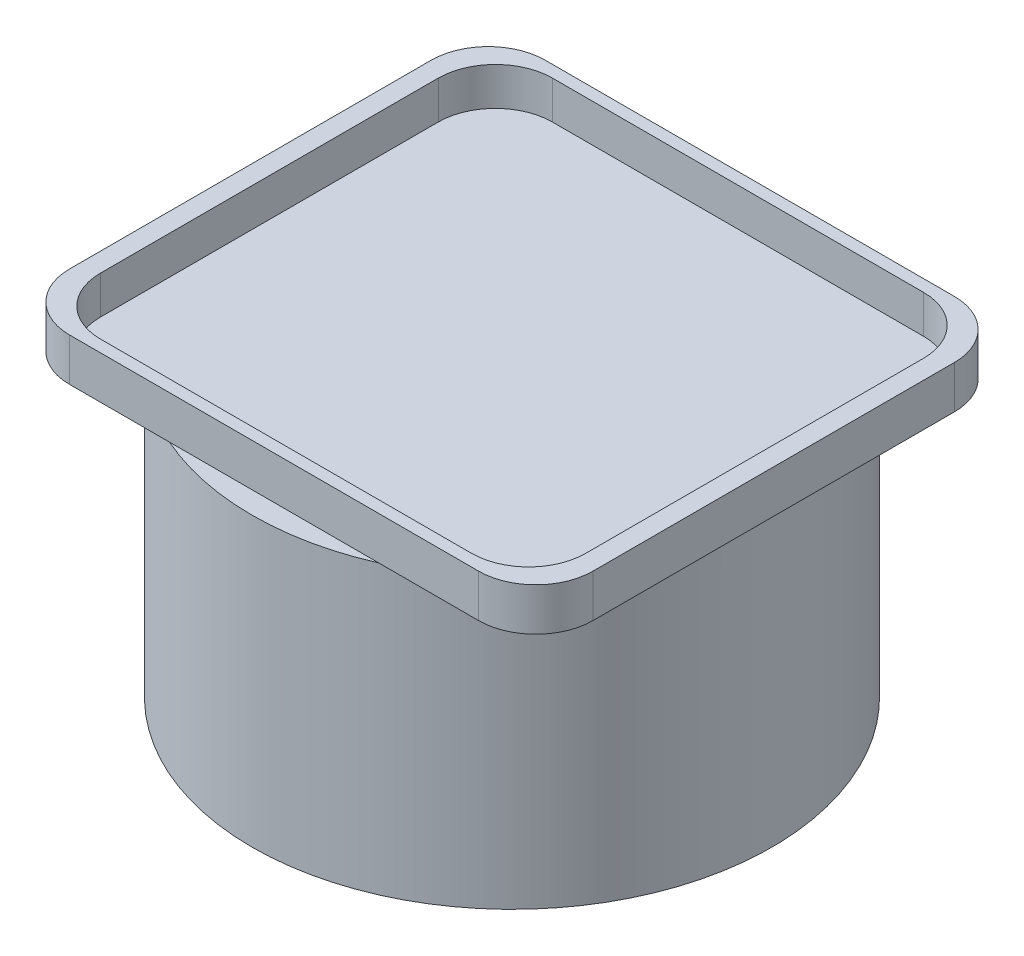
ISO-10303-21;
HEADER;
FILE_DESCRIPTION(('STEP AP214'),'2;1');
FILE_NAME('part.step','',(''),(''),'','','');
FILE_SCHEMA(('AUTOMOTIVE_DESIGN { 1 0 10303 214 1 1 1 1 }'));
ENDSEC;
DATA;
#1=APPLICATION_CONTEXT('core data for automotive mechanical design processes');
#2=APPLICATION_PROTOCOL_DEFINITION('international standard','automotive_design',2000,#1);
#3=PRODUCT_CONTEXT('',#1,'mechanical');
#4=PRODUCT('Part','Part','',(#3));
#5=PRODUCT_RELATED_PRODUCT_CATEGORY('part','',(#4));
#6=PRODUCT_DEFINITION_FORMATION('','',#4);
#7=PRODUCT_DEFINITION_CONTEXT('part definition',#1,'design');
#8=PRODUCT_DEFINITION('design','',#6,#7);
#9=PRODUCT_DEFINITION_SHAPE('','',#8);
#10=(LENGTH_UNIT() NAMED_UNIT(*) SI_UNIT(.MILLI.,.METRE.));
#11=(NAMED_UNIT(*) PLANE_ANGLE_UNIT() SI_UNIT($,.RADIAN.));
#12=(NAMED_UNIT(*) SI_UNIT($,.STERADIAN.) SOLID_ANGLE_UNIT());
#13=UNCERTAINTY_MEASURE_WITH_UNIT(LENGTH_MEASURE(1.E-05),#10,'distance_accuracy_value','');
#14=(GEOMETRIC_REPRESENTATION_CONTEXT(3) GLOBAL_UNCERTAINTY_ASSIGNED_CONTEXT((#13)) GLOBAL_UNIT_ASSIGNED_CONTEXT((#10,
#11,#12)) REPRESENTATION_CONTEXT('',''));
#15=CARTESIAN_POINT('',(0.,0.,0.));
#16=DIRECTION('',(0.,0.,1.));
#17=DIRECTION('',(1.,0.,0.));
#18=AXIS2_PLACEMENT_3D('',#15,#16,#17);
#19=CARTESIAN_POINT('',(-10.922,-0.254,-9.652));
#20=DIRECTION('',(0.,-1.,0.));
#21=DIRECTION('',(0.,0.,-1.));
#22=AXIS2_PLACEMENT_3D('',#19,#20,#21);
#23=PLANE('',#22);
#24=CARTESIAN_POINT('',(0.,-0.254,0.));
#25=DIRECTION('',(0.,-1.,0.));
#26=DIRECTION('',(0.,0.,-1.));
#27=AXIS2_PLACEMENT_3D('',#24,#25,#26);
#28=CIRCLE('',#27,13.87475);
#29=CARTESIAN_POINT('',(5.58736857227979,-0.254,-12.7));
#30=VERTEX_POINT('',#29);
#31=CARTESIAN_POINT('',(5.5873685722798,-0.254,12.7));
#32=VERTEX_POINT('',#31);
#33=EDGE_CURVE('E50',#30,#32,#28,.T.);
#34=ORIENTED_EDGE('',*,*,#33,.F.);
#35=DIRECTION('',(1.,0.,0.));
#36=VECTOR('',#35,1.);
#37=CARTESIAN_POINT('',(-10.922,-0.254,-12.7));
#38=LINE('',#37,#36);
#39=CARTESIAN_POINT('',(10.922,-0.254,-12.7));
#40=VERTEX_POINT('',#39);
#41=EDGE_CURVE('E178',#30,#40,#38,.T.);
#42=ORIENTED_EDGE('',*,*,#41,.T.);
#43=CARTESIAN_POINT('',(10.922,-0.254,-9.652));
#44=DIRECTION('',(0.,-1.,0.));
#45=DIRECTION('',(0.,0.,-1.));
#46=AXIS2_PLACEMENT_3D('',#43,#44,#45);
#47=CIRCLE('',#46,3.048);
#48=CARTESIAN_POINT('',(13.97,-0.254,-9.652));
#49=VERTEX_POINT('',#48);
#50=EDGE_CURVE('E175',#40,#49,#47,.T.);
#51=ORIENTED_EDGE('',*,*,#50,.T.);
#52=DIRECTION('',(0.,0.,1.));
#53=VECTOR('',#52,1.);
#54=CARTESIAN_POINT('',(13.97,-0.254,-9.652));
#55=LINE('',#54,#53);
#56=CARTESIAN_POINT('',(13.97,-0.254,9.65199999999998));
#57=VERTEX_POINT('',#56);
#58=EDGE_CURVE('E206',#49,#57,#55,.T.);
#59=ORIENTED_EDGE('',*,*,#58,.T.);
#60=CARTESIAN_POINT('',(10.922,-0.254,9.652));
#61=DIRECTION('',(0.,-1.,0.));
#62=DIRECTION('',(0.,0.,-1.));
#63=AXIS2_PLACEMENT_3D('',#60,#61,#62);
#64=CIRCLE('',#63,3.048);
#65=CARTESIAN_POINT('',(10.922,-0.254,12.7));
#66=VERTEX_POINT('',#65);
#67=EDGE_CURVE('E210',#57,#66,#64,.T.);
#68=ORIENTED_EDGE('',*,*,#67,.T.);
#69=DIRECTION('',(-1.,0.,0.));
#70=VECTOR('',#69,1.);
#71=CARTESIAN_POINT('',(10.922,-0.254,12.7));
#72=LINE('',#71,#70);
#73=EDGE_CURVE('E215',#66,#32,#72,.T.);
#74=ORIENTED_EDGE('',*,*,#73,.T.);
#75=EDGE_LOOP('',(#34,#42,#51,#59,#68,#74));
#76=FACE_BOUND('',#75,.T.);
#77=ADVANCED_FACE('F39',(#76),#23,.T.);
#78=CARTESIAN_POINT('',(-10.922,2.032,-9.652));
#79=DIRECTION('',(0.,-1.,0.));
#80=DIRECTION('',(0.,0.,-1.));
#81=AXIS2_PLACEMENT_3D('',#78,#79,#80);
#82=PLANE('',#81);
#83=CARTESIAN_POINT('',(-10.922,2.032,-9.652));
#84=DIRECTION('',(0.,1.,0.));
#85=DIRECTION('',(0.,0.,-1.));
#86=AXIS2_PLACEMENT_3D('',#83,#84,#85);
#87=CIRCLE('',#86,3.048);
#88=CARTESIAN_POINT('',(-10.922,2.032,-12.7));
#89=VERTEX_POINT('',#88);
#90=CARTESIAN_POINT('',(-13.97,2.032,-9.65199999999998));
#91=VERTEX_POINT('',#90);
#92=EDGE_CURVE('E309',#89,#91,#87,.T.);
#93=ORIENTED_EDGE('',*,*,#92,.T.);
#94=DIRECTION('',(0.,0.,1.));
#95=VECTOR('',#94,1.);
#96=CARTESIAN_POINT('',(-13.97,2.032,9.65199999999998));
#97=LINE('',#96,#95);
#98=CARTESIAN_POINT('',(-13.97,2.032,9.65199999999998));
#99=VERTEX_POINT('',#98);
#100=EDGE_CURVE('E313',#91,#99,#97,.T.);
#101=ORIENTED_EDGE('',*,*,#100,.T.);
#102=CARTESIAN_POINT('',(-10.922,2.032,9.652));
#103=DIRECTION('',(0.,1.,0.));
#104=DIRECTION('',(0.,0.,-1.));
#105=AXIS2_PLACEMENT_3D('',#102,#103,#104);
#106=CIRCLE('',#105,3.048);
#107=CARTESIAN_POINT('',(-10.922,2.032,12.7));
#108=VERTEX_POINT('',#107);
#109=EDGE_CURVE('E316',#99,#108,#106,.T.);
#110=ORIENTED_EDGE('',*,*,#109,.T.);
#111=DIRECTION('',(1.,0.,0.));
#112=VECTOR('',#111,1.);
#113=CARTESIAN_POINT('',(-10.922,2.032,12.7));
#114=LINE('',#113,#112);
#115=CARTESIAN_POINT('',(10.922,2.032,12.7));
#116=VERTEX_POINT('',#115);
#117=EDGE_CURVE('E319',#108,#116,#114,.T.);
#118=ORIENTED_EDGE('',*,*,#117,.T.);
#119=CARTESIAN_POINT('',(10.922,2.032,9.652));
#120=DIRECTION('',(0.,1.,0.));
#121=DIRECTION('',(0.,0.,-1.));
#122=AXIS2_PLACEMENT_3D('',#119,#120,#121);
#123=CIRCLE('',#122,3.048);
#124=CARTESIAN_POINT('',(13.97,2.032,9.65199999999998));
#125=VERTEX_POINT('',#124);
#126=EDGE_CURVE('E322',#116,#125,#123,.T.);
#127=ORIENTED_EDGE('',*,*,#126,.T.);
#128=DIRECTION('',(0.,0.,-1.));
#129=VECTOR('',#128,1.);
#130=CARTESIAN_POINT('',(13.97,2.032,9.65199999999998));
#131=LINE('',#130,#129);
#132=CARTESIAN_POINT('',(13.97,2.032,-9.65199999999998));
#133=VERTEX_POINT('',#132);
#134=EDGE_CURVE('E325',#125,#133,#131,.T.);
#135=ORIENTED_EDGE('',*,*,#134,.T.);
#136=CARTESIAN_POINT('',(10.922,2.032,-9.652));
#137=DIRECTION('',(0.,1.,0.));
#138=DIRECTION('',(0.,0.,-1.));
#139=AXIS2_PLACEMENT_3D('',#136,#137,#138);
#140=CIRCLE('',#139,3.048);
#141=CARTESIAN_POINT('',(10.922,2.032,-12.7));
#142=VERTEX_POINT('',#141);
#143=EDGE_CURVE('E328',#133,#142,#140,.T.);
#144=ORIENTED_EDGE('',*,*,#143,.T.);
#145=DIRECTION('',(-1.,0.,0.));
#146=VECTOR('',#145,1.);
#147=CARTESIAN_POINT('',(-10.922,2.032,-12.7));
#148=LINE('',#147,#146);
#149=EDGE_CURVE('E331',#142,#89,#148,.T.);
#150=ORIENTED_EDGE('',*,*,#149,.T.);
#151=EDGE_LOOP('',(#93,#101,#110,#118,#127,#135,#144,#150));
#152=FACE_BOUND('',#151,.T.);
#153=CARTESIAN_POINT('',(-9.906,2.032,9.017));
#154=DIRECTION('',(0.,1.,0.));
#155=DIRECTION('',(0.,0.,1.));
#156=AXIS2_PLACEMENT_3D('',#153,#154,#155);
#157=CIRCLE('',#156,3.048);
#158=CARTESIAN_POINT('',(-12.954,2.032,9.01699999999998));
#159=VERTEX_POINT('',#158);
#160=CARTESIAN_POINT('',(-9.90599999999998,2.032,12.065));
#161=VERTEX_POINT('',#160);
#162=EDGE_CURVE('E226',#159,#161,#157,.T.);
#163=ORIENTED_EDGE('',*,*,#162,.F.);
#164=DIRECTION('',(0.,0.,1.));
#165=VECTOR('',#164,1.);
#166=CARTESIAN_POINT('',(-12.954,2.032,9.01699999999998));
#167=LINE('',#166,#165);
#168=CARTESIAN_POINT('',(-12.954,2.032,-9.01699999999998));
#169=VERTEX_POINT('',#168);
#170=EDGE_CURVE('E249',#169,#159,#167,.T.);
#171=ORIENTED_EDGE('',*,*,#170,.F.);
#172=CARTESIAN_POINT('',(-9.906,2.032,-9.017));
#173=DIRECTION('',(0.,1.,0.));
#174=DIRECTION('',(0.,0.,1.));
#175=AXIS2_PLACEMENT_3D('',#172,#173,#174);
#176=CIRCLE('',#175,3.048);
#177=CARTESIAN_POINT('',(-9.90599999999998,2.032,-12.065));
#178=VERTEX_POINT('',#177);
#179=EDGE_CURVE('E245',#178,#169,#176,.T.);
#180=ORIENTED_EDGE('',*,*,#179,.F.);
#181=DIRECTION('',(-1.,0.,0.));
#182=VECTOR('',#181,1.);
#183=CARTESIAN_POINT('',(-9.90599999999998,2.032,-12.065));
#184=LINE('',#183,#182);
#185=CARTESIAN_POINT('',(9.90599999999998,2.032,-12.065));
#186=VERTEX_POINT('',#185);
#187=EDGE_CURVE('E242',#186,#178,#184,.T.);
#188=ORIENTED_EDGE('',*,*,#187,.F.);
#189=CARTESIAN_POINT('',(9.906,2.032,-9.017));
#190=DIRECTION('',(0.,1.,0.));
#191=DIRECTION('',(0.,0.,1.));
#192=AXIS2_PLACEMENT_3D('',#189,#190,#191);
#193=CIRCLE('',#192,3.048);
#194=CARTESIAN_POINT('',(12.954,2.032,-9.01699999999998));
#195=VERTEX_POINT('',#194);
#196=EDGE_CURVE('E239',#195,#186,#193,.T.);
#197=ORIENTED_EDGE('',*,*,#196,.F.);
#198=DIRECTION('',(0.,0.,-1.));
#199=VECTOR('',#198,1.);
#200=CARTESIAN_POINT('',(12.954,2.032,9.01699999999998));
#201=LINE('',#200,#199);
#202=CARTESIAN_POINT('',(12.954,2.032,9.01699999999998));
#203=VERTEX_POINT('',#202);
#204=EDGE_CURVE('E236',#203,#195,#201,.T.);
#205=ORIENTED_EDGE('',*,*,#204,.F.);
#206=CARTESIAN_POINT('',(9.906,2.032,9.017));
#207=DIRECTION('',(0.,1.,0.));
#208=DIRECTION('',(0.,0.,1.));
#209=AXIS2_PLACEMENT_3D('',#206,#207,#208);
#210=CIRCLE('',#209,3.048);
#211=CARTESIAN_POINT('',(9.90599999999998,2.032,12.065));
#212=VERTEX_POINT('',#211);
#213=EDGE_CURVE('E233',#212,#203,#210,.T.);
#214=ORIENTED_EDGE('',*,*,#213,.F.);
#215=DIRECTION('',(1.,0.,0.));
#216=VECTOR('',#215,1.);
#217=CARTESIAN_POINT('',(-9.90599999999998,2.032,12.065));
#218=LINE('',#217,#216);
#219=EDGE_CURVE('E229',#161,#212,#218,.T.);
#220=ORIENTED_EDGE('',*,*,#219,.F.);
#221=EDGE_LOOP('',(#163,#171,#180,#188,#197,#205,#214,#220));
#222=FACE_BOUND('',#221,.T.);
#223=ADVANCED_FACE('F369',(#152,#222),#82,.F.);
#224=CARTESIAN_POINT('',(-10.922,2.032,-9.652));
#225=DIRECTION('',(0.,-1.,0.));
#226=DIRECTION('',(0.,0.,-1.));
#227=AXIS2_PLACEMENT_3D('',#224,#225,#226);
#228=CYLINDRICAL_SURFACE('',#227,3.048);
#229=DIRECTION('',(0.,-1.,0.));
#230=VECTOR('',#229,1.);
#231=CARTESIAN_POINT('',(-10.922,2.032,-12.7));
#232=LINE('',#231,#230);
#233=CARTESIAN_POINT('',(-10.922,-0.254,-12.7));
#234=VERTEX_POINT('',#233);
#235=EDGE_CURVE('E334',#89,#234,#232,.T.);
#236=ORIENTED_EDGE('',*,*,#235,.T.);
#237=CARTESIAN_POINT('',(-10.922,-0.254,-9.652));
#238=DIRECTION('',(0.,-1.,0.));
#239=DIRECTION('',(0.,0.,-1.));
#240=AXIS2_PLACEMENT_3D('',#237,#238,#239);
#241=CIRCLE('',#240,3.048);
#242=CARTESIAN_POINT('',(-13.97,-0.254,-9.65199999999998));
#243=VERTEX_POINT('',#242);
#244=EDGE_CURVE('E171',#243,#234,#241,.T.);
#245=ORIENTED_EDGE('',*,*,#244,.F.);
#246=DIRECTION('',(0.,-1.,0.));
#247=VECTOR('',#246,1.);
#248=CARTESIAN_POINT('',(-13.97,2.032,-9.65199999999998));
#249=LINE('',#248,#247);
#250=EDGE_CURVE('E43',#91,#243,#249,.T.);
#251=ORIENTED_EDGE('',*,*,#250,.F.);
#252=ORIENTED_EDGE('',*,*,#92,.F.);
#253=EDGE_LOOP('',(#236,#245,#251,#252));
#254=FACE_BOUND('',#253,.T.);
#255=ADVANCED_FACE('F41',(#254),#228,.T.);
#256=CARTESIAN_POINT('',(-13.97,2.032,9.65199999999998));
#257=DIRECTION('',(1.,0.,0.));
#258=DIRECTION('',(0.,0.,-1.));
#259=AXIS2_PLACEMENT_3D('',#256,#257,#258);
#260=PLANE('',#259);
#261=ORIENTED_EDGE('',*,*,#250,.T.);
#262=DIRECTION('',(0.,0.,-1.));
#263=VECTOR('',#262,1.);
#264=CARTESIAN_POINT('',(-13.97,-0.254,9.65199999999998));
#265=LINE('',#264,#263);
#266=CARTESIAN_POINT('',(-13.97,-0.254,9.65199999999998));
#267=VERTEX_POINT('',#266);
#268=EDGE_CURVE('E222',#267,#243,#265,.T.);
#269=ORIENTED_EDGE('',*,*,#268,.F.);
#270=DIRECTION('',(0.,-1.,0.));
#271=VECTOR('',#270,1.);
#272=CARTESIAN_POINT('',(-13.97,2.032,9.65199999999998));
#273=LINE('',#272,#271);
#274=EDGE_CURVE('E352',#99,#267,#273,.T.);
#275=ORIENTED_EDGE('',*,*,#274,.F.);
#276=ORIENTED_EDGE('',*,*,#100,.F.);
#277=EDGE_LOOP('',(#261,#269,#275,#276));
#278=FACE_BOUND('',#277,.T.);
#279=ADVANCED_FACE('F362',(#278),#260,.F.);
#280=CARTESIAN_POINT('',(-10.922,2.032,9.652));
#281=DIRECTION('',(0.,-1.,0.));
#282=DIRECTION('',(0.,0.,-1.));
#283=AXIS2_PLACEMENT_3D('',#280,#281,#282);
#284=CYLINDRICAL_SURFACE('',#283,3.048);
#285=ORIENTED_EDGE('',*,*,#274,.T.);
#286=CARTESIAN_POINT('',(-10.922,-0.254,9.652));
#287=DIRECTION('',(0.,-1.,0.));
#288=DIRECTION('',(0.,0.,-1.));
#289=AXIS2_PLACEMENT_3D('',#286,#287,#288);
#290=CIRCLE('',#289,3.048);
#291=CARTESIAN_POINT('',(-10.922,-0.254,12.7));
#292=VERTEX_POINT('',#291);
#293=EDGE_CURVE('E218',#292,#267,#290,.T.);
#294=ORIENTED_EDGE('',*,*,#293,.F.);
#295=DIRECTION('',(0.,-1.,0.));
#296=VECTOR('',#295,1.);
#297=CARTESIAN_POINT('',(-10.922,2.032,12.7));
#298=LINE('',#297,#296);
#299=EDGE_CURVE('E349',#108,#292,#298,.T.);
#300=ORIENTED_EDGE('',*,*,#299,.F.);
#301=ORIENTED_EDGE('',*,*,#109,.F.);
#302=EDGE_LOOP('',(#285,#294,#300,#301));
#303=FACE_BOUND('',#302,.T.);
#304=ADVANCED_FACE('F389',(#303),#284,.T.);
#305=CARTESIAN_POINT('',(-10.922,2.032,12.7));
#306=DIRECTION('',(0.,0.,-1.));
#307=DIRECTION('',(-1.,0.,0.));
#308=AXIS2_PLACEMENT_3D('',#305,#306,#307);
#309=PLANE('',#308);
#310=ORIENTED_EDGE('',*,*,#299,.T.);
#311=CARTESIAN_POINT('',(-5.5873685722798,-0.254,12.7));
#312=VERTEX_POINT('',#311);
#313=EDGE_CURVE('E214',#312,#292,#72,.T.);
#314=ORIENTED_EDGE('',*,*,#313,.F.);
#315=EDGE_CURVE('E63',#32,#312,#72,.T.);
#316=ORIENTED_EDGE('',*,*,#315,.F.);
#317=ORIENTED_EDGE('',*,*,#73,.F.);
#318=DIRECTION('',(0.,-1.,0.));
#319=VECTOR('',#318,1.);
#320=CARTESIAN_POINT('',(10.922,2.032,12.7));
#321=LINE('',#320,#319);
#322=EDGE_CURVE('E346',#116,#66,#321,.T.);
#323=ORIENTED_EDGE('',*,*,#322,.F.);
#324=ORIENTED_EDGE('',*,*,#117,.F.);
#325=EDGE_LOOP('',(#310,#314,#316,#317,#323,#324));
#326=FACE_BOUND('',#325,.T.);
#327=ADVANCED_FACE('F386',(#326),#309,.F.);
#328=CARTESIAN_POINT('',(10.922,2.032,9.652));
#329=DIRECTION('',(0.,-1.,0.));
#330=DIRECTION('',(0.,0.,-1.));
#331=AXIS2_PLACEMENT_3D('',#328,#329,#330);
#332=CYLINDRICAL_SURFACE('',#331,3.048);
#333=ORIENTED_EDGE('',*,*,#322,.T.);
#334=ORIENTED_EDGE('',*,*,#67,.F.);
#335=DIRECTION('',(0.,-1.,0.));
#336=VECTOR('',#335,1.);
#337=CARTESIAN_POINT('',(13.97,2.032,9.65199999999998));
#338=LINE('',#337,#336);
#339=EDGE_CURVE('E343',#125,#57,#338,.T.);
#340=ORIENTED_EDGE('',*,*,#339,.F.);
#341=ORIENTED_EDGE('',*,*,#126,.F.);
#342=EDGE_LOOP('',(#333,#334,#340,#341));
#343=FACE_BOUND('',#342,.T.);
#344=ADVANCED_FACE('F384',(#343),#332,.T.);
#345=CARTESIAN_POINT('',(13.97,2.032,9.65199999999998));
#346=DIRECTION('',(-1.,0.,0.));
#347=DIRECTION('',(0.,0.,1.));
#348=AXIS2_PLACEMENT_3D('',#345,#346,#347);
#349=PLANE('',#348);
#350=ORIENTED_EDGE('',*,*,#339,.T.);
#351=ORIENTED_EDGE('',*,*,#58,.F.);
#352=DIRECTION('',(0.,-1.,0.));
#353=VECTOR('',#352,1.);
#354=CARTESIAN_POINT('',(13.97,2.032,-9.65199999999998));
#355=LINE('',#354,#353);
#356=EDGE_CURVE('E340',#133,#49,#355,.T.);
#357=ORIENTED_EDGE('',*,*,#356,.F.);
#358=ORIENTED_EDGE('',*,*,#134,.F.);
#359=EDGE_LOOP('',(#350,#351,#357,#358));
#360=FACE_BOUND('',#359,.T.);
#361=ADVANCED_FACE('F380',(#360),#349,.F.);
#362=CARTESIAN_POINT('',(10.922,2.032,-9.652));
#363=DIRECTION('',(0.,-1.,0.));
#364=DIRECTION('',(0.,0.,-1.));
#365=AXIS2_PLACEMENT_3D('',#362,#363,#364);
#366=CYLINDRICAL_SURFACE('',#365,3.048);
#367=ORIENTED_EDGE('',*,*,#356,.T.);
#368=ORIENTED_EDGE('',*,*,#50,.F.);
#369=DIRECTION('',(0.,-1.,0.));
#370=VECTOR('',#369,1.);
#371=CARTESIAN_POINT('',(10.922,2.032,-12.7));
#372=LINE('',#371,#370);
#373=EDGE_CURVE('E337',#142,#40,#372,.T.);
#374=ORIENTED_EDGE('',*,*,#373,.F.);
#375=ORIENTED_EDGE('',*,*,#143,.F.);
#376=EDGE_LOOP('',(#367,#368,#374,#375));
#377=FACE_BOUND('',#376,.T.);
#378=ADVANCED_FACE('F375',(#377),#366,.T.);
#379=CARTESIAN_POINT('',(-10.922,2.032,-12.7));
#380=DIRECTION('',(0.,0.,1.));
#381=DIRECTION('',(1.,0.,0.));
#382=AXIS2_PLACEMENT_3D('',#379,#380,#381);
#383=PLANE('',#382);
#384=ORIENTED_EDGE('',*,*,#373,.T.);
#385=ORIENTED_EDGE('',*,*,#41,.F.);
#386=CARTESIAN_POINT('',(-5.58736857227979,-0.254,-12.7));
#387=VERTEX_POINT('',#386);
#388=EDGE_CURVE('E176',#387,#30,#38,.T.);
#389=ORIENTED_EDGE('',*,*,#388,.F.);
#390=EDGE_CURVE('E166',#234,#387,#38,.T.);
#391=ORIENTED_EDGE('',*,*,#390,.F.);
#392=ORIENTED_EDGE('',*,*,#235,.F.);
#393=ORIENTED_EDGE('',*,*,#149,.F.);
#394=EDGE_LOOP('',(#384,#385,#389,#391,#392,#393));
#395=FACE_BOUND('',#394,.T.);
#396=ADVANCED_FACE('F183',(#395),#383,.F.);
#397=CARTESIAN_POINT('',(-9.906,2.032,9.017));
#398=DIRECTION('',(0.,-1.,0.));
#399=DIRECTION('',(0.,0.,-1.));
#400=AXIS2_PLACEMENT_3D('',#397,#398,#399);
#401=CYLINDRICAL_SURFACE('',#400,3.048);
#402=CARTESIAN_POINT('',(-9.906,0.,9.017));
#403=DIRECTION('',(0.,1.,0.));
#404=DIRECTION('',(0.,0.,1.));
#405=AXIS2_PLACEMENT_3D('',#402,#403,#404);
#406=CIRCLE('',#405,3.048);
#407=CARTESIAN_POINT('',(-12.954,0.,9.01699999999998));
#408=VERTEX_POINT('',#407);
#409=CARTESIAN_POINT('',(-9.90599999999998,0.,12.065));
#410=VERTEX_POINT('',#409);
#411=EDGE_CURVE('E225',#408,#410,#406,.T.);
#412=ORIENTED_EDGE('',*,*,#411,.F.);
#413=DIRECTION('',(0.,-1.,0.));
#414=VECTOR('',#413,1.);
#415=CARTESIAN_POINT('',(-12.954,2.032,9.01699999999998));
#416=LINE('',#415,#414);
#417=EDGE_CURVE('E252',#159,#408,#416,.T.);
#418=ORIENTED_EDGE('',*,*,#417,.F.);
#419=ORIENTED_EDGE('',*,*,#162,.T.);
#420=DIRECTION('',(0.,-1.,0.));
#421=VECTOR('',#420,1.);
#422=CARTESIAN_POINT('',(-9.90599999999998,2.032,12.065));
#423=LINE('',#422,#421);
#424=EDGE_CURVE('E305',#161,#410,#423,.T.);
#425=ORIENTED_EDGE('',*,*,#424,.T.);
#426=EDGE_LOOP('',(#412,#418,#419,#425));
#427=FACE_BOUND('',#426,.T.);
#428=ADVANCED_FACE('F444',(#427),#401,.F.);
#429=CARTESIAN_POINT('',(-9.90599999999998,2.032,12.065));
#430=DIRECTION('',(0.,0.,-1.));
#431=DIRECTION('',(-1.,0.,0.));
#432=AXIS2_PLACEMENT_3D('',#429,#430,#431);
#433=PLANE('',#432);
#434=DIRECTION('',(1.,0.,0.));
#435=VECTOR('',#434,1.);
#436=CARTESIAN_POINT('',(-9.90599999999998,0.,12.065));
#437=LINE('',#436,#435);
#438=CARTESIAN_POINT('',(9.90599999999998,0.,12.065));
#439=VERTEX_POINT('',#438);
#440=EDGE_CURVE('E256',#410,#439,#437,.T.);
#441=ORIENTED_EDGE('',*,*,#440,.F.);
#442=ORIENTED_EDGE('',*,*,#424,.F.);
#443=ORIENTED_EDGE('',*,*,#219,.T.);
#444=DIRECTION('',(0.,-1.,0.));
#445=VECTOR('',#444,1.);
#446=CARTESIAN_POINT('',(9.90599999999998,2.032,12.065));
#447=LINE('',#446,#445);
#448=EDGE_CURVE('E302',#212,#439,#447,.T.);
#449=ORIENTED_EDGE('',*,*,#448,.T.);
#450=EDGE_LOOP('',(#441,#442,#443,#449));
#451=FACE_BOUND('',#450,.T.);
#452=ADVANCED_FACE('F440',(#451),#433,.T.);
#453=CARTESIAN_POINT('',(9.906,2.032,9.017));
#454=DIRECTION('',(0.,-1.,0.));
#455=DIRECTION('',(0.,0.,-1.));
#456=AXIS2_PLACEMENT_3D('',#453,#454,#455);
#457=CYLINDRICAL_SURFACE('',#456,3.048);
#458=CARTESIAN_POINT('',(9.906,0.,9.017));
#459=DIRECTION('',(0.,1.,0.));
#460=DIRECTION('',(0.,0.,1.));
#461=AXIS2_PLACEMENT_3D('',#458,#459,#460);
#462=CIRCLE('',#461,3.048);
#463=CARTESIAN_POINT('',(12.954,0.,9.01699999999998));
#464=VERTEX_POINT('',#463);
#465=EDGE_CURVE('E260',#439,#464,#462,.T.);
#466=ORIENTED_EDGE('',*,*,#465,.F.);
#467=ORIENTED_EDGE('',*,*,#448,.F.);
#468=ORIENTED_EDGE('',*,*,#213,.T.);
#469=DIRECTION('',(0.,-1.,0.));
#470=VECTOR('',#469,1.);
#471=CARTESIAN_POINT('',(12.954,2.032,9.01699999999998));
#472=LINE('',#471,#470);
#473=EDGE_CURVE('E299',#203,#464,#472,.T.);
#474=ORIENTED_EDGE('',*,*,#473,.T.);
#475=EDGE_LOOP('',(#466,#467,#468,#474));
#476=FACE_BOUND('',#475,.T.);
#477=ADVANCED_FACE('F436',(#476),#457,.F.);
#478=CARTESIAN_POINT('',(12.954,2.032,9.01699999999998));
#479=DIRECTION('',(-1.,0.,0.));
#480=DIRECTION('',(0.,0.,1.));
#481=AXIS2_PLACEMENT_3D('',#478,#479,#480);
#482=PLANE('',#481);
#483=DIRECTION('',(0.,0.,-1.));
#484=VECTOR('',#483,1.);
#485=CARTESIAN_POINT('',(12.954,0.,9.01699999999998));
#486=LINE('',#485,#484);
#487=CARTESIAN_POINT('',(12.954,0.,-9.01699999999998));
#488=VERTEX_POINT('',#487);
#489=EDGE_CURVE('E264',#464,#488,#486,.T.);
#490=ORIENTED_EDGE('',*,*,#489,.F.);
#491=ORIENTED_EDGE('',*,*,#473,.F.);
#492=ORIENTED_EDGE('',*,*,#204,.T.);
#493=DIRECTION('',(0.,-1.,0.));
#494=VECTOR('',#493,1.);
#495=CARTESIAN_POINT('',(12.954,2.032,-9.01699999999998));
#496=LINE('',#495,#494);
#497=EDGE_CURVE('E296',#195,#488,#496,.T.);
#498=ORIENTED_EDGE('',*,*,#497,.T.);
#499=EDGE_LOOP('',(#490,#491,#492,#498));
#500=FACE_BOUND('',#499,.T.);
#501=ADVANCED_FACE('F432',(#500),#482,.T.);
#502=CARTESIAN_POINT('',(9.906,2.032,-9.017));
#503=DIRECTION('',(0.,-1.,0.));
#504=DIRECTION('',(0.,0.,-1.));
#505=AXIS2_PLACEMENT_3D('',#502,#503,#504);
#506=CYLINDRICAL_SURFACE('',#505,3.048);
#507=CARTESIAN_POINT('',(9.906,0.,-9.017));
#508=DIRECTION('',(0.,1.,0.));
#509=DIRECTION('',(0.,0.,1.));
#510=AXIS2_PLACEMENT_3D('',#507,#508,#509);
#511=CIRCLE('',#510,3.048);
#512=CARTESIAN_POINT('',(9.90599999999998,0.,-12.065));
#513=VERTEX_POINT('',#512);
#514=EDGE_CURVE('E268',#488,#513,#511,.T.);
#515=ORIENTED_EDGE('',*,*,#514,.F.);
#516=ORIENTED_EDGE('',*,*,#497,.F.);
#517=ORIENTED_EDGE('',*,*,#196,.T.);
#518=DIRECTION('',(0.,-1.,0.));
#519=VECTOR('',#518,1.);
#520=CARTESIAN_POINT('',(9.90599999999998,2.032,-12.065));
#521=LINE('',#520,#519);
#522=EDGE_CURVE('E293',#186,#513,#521,.T.);
#523=ORIENTED_EDGE('',*,*,#522,.T.);
#524=EDGE_LOOP('',(#515,#516,#517,#523));
#525=FACE_BOUND('',#524,.T.);
#526=ADVANCED_FACE('F428',(#525),#506,.F.);
#527=CARTESIAN_POINT('',(-9.90599999999998,2.032,-12.065));
#528=DIRECTION('',(0.,0.,1.));
#529=DIRECTION('',(1.,0.,0.));
#530=AXIS2_PLACEMENT_3D('',#527,#528,#529);
#531=PLANE('',#530);
#532=DIRECTION('',(-1.,0.,0.));
#533=VECTOR('',#532,1.);
#534=CARTESIAN_POINT('',(-9.90599999999998,0.,-12.065));
#535=LINE('',#534,#533);
#536=CARTESIAN_POINT('',(-9.90599999999998,0.,-12.065));
#537=VERTEX_POINT('',#536);
#538=EDGE_CURVE('E272',#513,#537,#535,.T.);
#539=ORIENTED_EDGE('',*,*,#538,.F.);
#540=ORIENTED_EDGE('',*,*,#522,.F.);
#541=ORIENTED_EDGE('',*,*,#187,.T.);
#542=DIRECTION('',(0.,-1.,0.));
#543=VECTOR('',#542,1.);
#544=CARTESIAN_POINT('',(-9.90599999999998,2.032,-12.065));
#545=LINE('',#544,#543);
#546=EDGE_CURVE('E290',#178,#537,#545,.T.);
#547=ORIENTED_EDGE('',*,*,#546,.T.);
#548=EDGE_LOOP('',(#539,#540,#541,#547));
#549=FACE_BOUND('',#548,.T.);
#550=ADVANCED_FACE('F424',(#549),#531,.T.);
#551=CARTESIAN_POINT('',(-9.906,2.032,-9.017));
#552=DIRECTION('',(0.,-1.,0.));
#553=DIRECTION('',(0.,0.,-1.));
#554=AXIS2_PLACEMENT_3D('',#551,#552,#553);
#555=CYLINDRICAL_SURFACE('',#554,3.048);
#556=CARTESIAN_POINT('',(-9.906,0.,-9.017));
#557=DIRECTION('',(0.,1.,0.));
#558=DIRECTION('',(0.,0.,1.));
#559=AXIS2_PLACEMENT_3D('',#556,#557,#558);
#560=CIRCLE('',#559,3.048);
#561=CARTESIAN_POINT('',(-12.954,0.,-9.01699999999998));
#562=VERTEX_POINT('',#561);
#563=EDGE_CURVE('E276',#537,#562,#560,.T.);
#564=ORIENTED_EDGE('',*,*,#563,.F.);
#565=ORIENTED_EDGE('',*,*,#546,.F.);
#566=ORIENTED_EDGE('',*,*,#179,.T.);
#567=DIRECTION('',(0.,-1.,0.));
#568=VECTOR('',#567,1.);
#569=CARTESIAN_POINT('',(-12.954,2.032,-9.01699999999998));
#570=LINE('',#569,#568);
#571=EDGE_CURVE('E286',#169,#562,#570,.T.);
#572=ORIENTED_EDGE('',*,*,#571,.T.);
#573=EDGE_LOOP('',(#564,#565,#566,#572));
#574=FACE_BOUND('',#573,.T.);
#575=ADVANCED_FACE('F418',(#574),#555,.F.);
#576=CARTESIAN_POINT('',(-12.954,2.032,9.01699999999998));
#577=DIRECTION('',(1.,0.,0.));
#578=DIRECTION('',(0.,0.,-1.));
#579=AXIS2_PLACEMENT_3D('',#576,#577,#578);
#580=PLANE('',#579);
#581=DIRECTION('',(0.,0.,1.));
#582=VECTOR('',#581,1.);
#583=CARTESIAN_POINT('',(-12.954,0.,9.01699999999998));
#584=LINE('',#583,#582);
#585=EDGE_CURVE('E230',#562,#408,#584,.T.);
#586=ORIENTED_EDGE('',*,*,#585,.F.);
#587=ORIENTED_EDGE('',*,*,#571,.F.);
#588=ORIENTED_EDGE('',*,*,#170,.T.);
#589=ORIENTED_EDGE('',*,*,#417,.T.);
#590=EDGE_LOOP('',(#586,#587,#588,#589));
#591=FACE_BOUND('',#590,.T.);
#592=ADVANCED_FACE('F413',(#591),#580,.T.);
#593=CARTESIAN_POINT('',(-10.922,0.,-9.652));
#594=DIRECTION('',(0.,-1.,0.));
#595=DIRECTION('',(0.,0.,-1.));
#596=AXIS2_PLACEMENT_3D('',#593,#594,#595);
#597=PLANE('',#596);
#598=ORIENTED_EDGE('',*,*,#563,.T.);
#599=ORIENTED_EDGE('',*,*,#585,.T.);
#600=ORIENTED_EDGE('',*,*,#411,.T.);
#601=ORIENTED_EDGE('',*,*,#440,.T.);
#602=ORIENTED_EDGE('',*,*,#465,.T.);
#603=ORIENTED_EDGE('',*,*,#489,.T.);
#604=ORIENTED_EDGE('',*,*,#514,.T.);
#605=ORIENTED_EDGE('',*,*,#538,.T.);
#606=EDGE_LOOP('',(#598,#599,#600,#601,#602,#603,#604,#605));
#607=FACE_BOUND('',#606,.T.);
#608=ADVANCED_FACE('F406',(#607),#597,.F.);
#609=EDGE_CURVE('E11',#312,#387,#28,.T.);
#610=ORIENTED_EDGE('',*,*,#609,.F.);
#611=ORIENTED_EDGE('',*,*,#313,.T.);
#612=ORIENTED_EDGE('',*,*,#293,.T.);
#613=ORIENTED_EDGE('',*,*,#268,.T.);
#614=ORIENTED_EDGE('',*,*,#244,.T.);
#615=ORIENTED_EDGE('',*,*,#390,.T.);
#616=EDGE_LOOP('',(#610,#611,#612,#613,#614,#615));
#617=FACE_BOUND('',#616,.T.);
#618=ADVANCED_FACE('F168',(#617),#23,.T.);
#619=CARTESIAN_POINT('',(0.,-0.254,0.));
#620=DIRECTION('',(0.,-1.,0.));
#621=DIRECTION('',(0.,0.,-1.));
#622=AXIS2_PLACEMENT_3D('',#619,#620,#621);
#623=PLANE('',#622);
#624=EDGE_CURVE('E187',#387,#30,#28,.T.);
#625=ORIENTED_EDGE('',*,*,#624,.F.);
#626=ORIENTED_EDGE('',*,*,#388,.T.);
#627=EDGE_LOOP('',(#625,#626));
#628=FACE_BOUND('',#627,.T.);
#629=ADVANCED_FACE('F188',(#628),#623,.F.);
#630=EDGE_CURVE('E51',#32,#312,#28,.T.);
#631=ORIENTED_EDGE('',*,*,#630,.F.);
#632=ORIENTED_EDGE('',*,*,#315,.T.);
#633=EDGE_LOOP('',(#631,#632));
#634=FACE_BOUND('',#633,.T.);
#635=ADVANCED_FACE('F411',(#634),#623,.F.);
#636=CARTESIAN_POINT('',(0.,-15.604,0.));
#637=DIRECTION('',(0.,1.,0.));
#638=DIRECTION('',(0.,0.,1.));
#639=AXIS2_PLACEMENT_3D('',#636,#637,#638);
#640=CYLINDRICAL_SURFACE('',#639,13.87475);
#641=CARTESIAN_POINT('',(0.,-15.604,0.));
#642=DIRECTION('',(0.,-1.,0.));
#643=DIRECTION('',(0.,0.,-1.));
#644=AXIS2_PLACEMENT_3D('',#641,#642,#643);
#645=CIRCLE('',#644,13.87475);
#646=CARTESIAN_POINT('',(0.,-15.604,-13.87475));
#647=VERTEX_POINT('',#646);
#648=EDGE_CURVE('E198',#647,#647,#645,.T.);
#649=ORIENTED_EDGE('',*,*,#648,.F.);
#650=EDGE_LOOP('',(#649));
#651=FACE_BOUND('',#650,.T.);
#652=ORIENTED_EDGE('',*,*,#33,.T.);
#653=ORIENTED_EDGE('',*,*,#630,.T.);
#654=ORIENTED_EDGE('',*,*,#609,.T.);
#655=ORIENTED_EDGE('',*,*,#624,.T.);
#656=EDGE_LOOP('',(#652,#653,#654,#655));
#657=FACE_BOUND('',#656,.T.);
#658=ADVANCED_FACE('F193',(#651,#657),#640,.T.);
#659=CARTESIAN_POINT('',(0.,-15.604,0.));
#660=DIRECTION('',(0.,-1.,0.));
#661=DIRECTION('',(0.,0.,-1.));
#662=AXIS2_PLACEMENT_3D('',#659,#660,#661);
#663=PLANE('',#662);
#664=ORIENTED_EDGE('',*,*,#648,.T.);
#665=EDGE_LOOP('',(#664));
#666=FACE_BOUND('',#665,.T.);
#667=ADVANCED_FACE('F609',(#666),#663,.T.);
#668=CLOSED_SHELL('',(#77,#223,#255,#279,#304,#327,#344,#361,#378,#396,#428,#452,#477,#501,#526,
#550,#575,#592,#608,#618,#629,#635,#658,#667));
#669=MANIFOLD_SOLID_BREP('B2',#668);
#670=ADVANCED_BREP_SHAPE_REPRESENTATION('',(#18,#669),#14);
#671=SHAPE_DEFINITION_REPRESENTATION(#9,#670);
ENDSEC;
END-ISO-10303-21;
